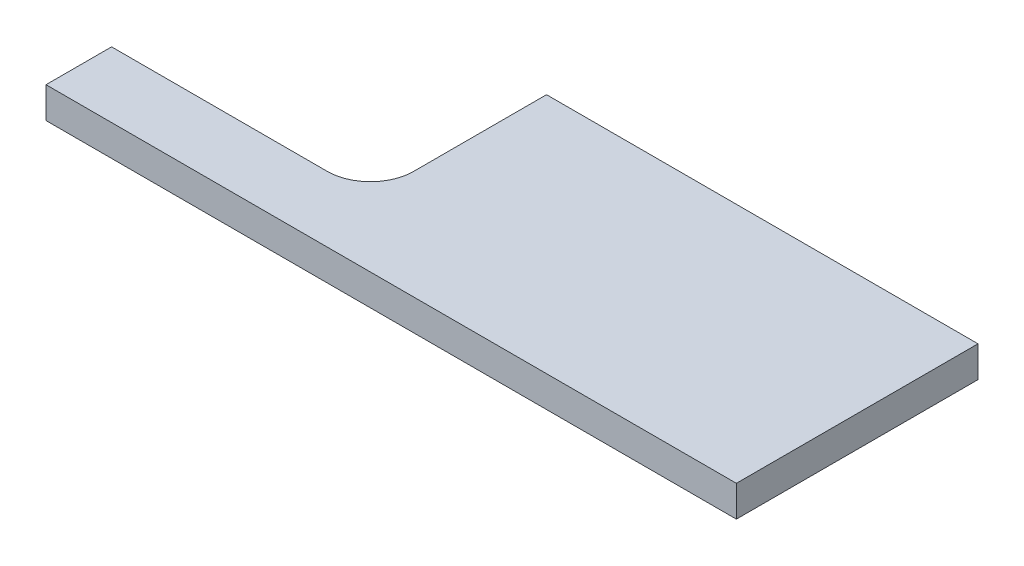
ISO-10303-21;
HEADER;
FILE_DESCRIPTION(('STEP AP214'),'2;1');
FILE_NAME('part.step','',(''),(''),'','','');
FILE_SCHEMA(('AUTOMOTIVE_DESIGN { 1 0 10303 214 1 1 1 1 }'));
ENDSEC;
DATA;
#1=APPLICATION_CONTEXT('core data for automotive mechanical design processes');
#2=APPLICATION_PROTOCOL_DEFINITION('international standard','automotive_design',2000,#1);
#3=PRODUCT_CONTEXT('',#1,'mechanical');
#4=PRODUCT('Part','Part','',(#3));
#5=PRODUCT_RELATED_PRODUCT_CATEGORY('part','',(#4));
#6=PRODUCT_DEFINITION_FORMATION('','',#4);
#7=PRODUCT_DEFINITION_CONTEXT('part definition',#1,'design');
#8=PRODUCT_DEFINITION('design','',#6,#7);
#9=PRODUCT_DEFINITION_SHAPE('','',#8);
#10=(LENGTH_UNIT() NAMED_UNIT(*) SI_UNIT(.MILLI.,.METRE.));
#11=(NAMED_UNIT(*) PLANE_ANGLE_UNIT() SI_UNIT($,.RADIAN.));
#12=(NAMED_UNIT(*) SI_UNIT($,.STERADIAN.) SOLID_ANGLE_UNIT());
#13=UNCERTAINTY_MEASURE_WITH_UNIT(LENGTH_MEASURE(1.E-05),#10,'distance_accuracy_value','');
#14=(GEOMETRIC_REPRESENTATION_CONTEXT(3) GLOBAL_UNCERTAINTY_ASSIGNED_CONTEXT((#13)) GLOBAL_UNIT_ASSIGNED_CONTEXT((#10,
#11,#12)) REPRESENTATION_CONTEXT('',''));
#15=CARTESIAN_POINT('',(0.,0.,0.));
#16=DIRECTION('',(0.,0.,1.));
#17=DIRECTION('',(1.,0.,0.));
#18=AXIS2_PLACEMENT_3D('',#15,#16,#17);
#19=CARTESIAN_POINT('',(66.9814991871768,18.,-25.));
#20=DIRECTION('',(1.,0.,0.));
#21=DIRECTION('',(0.,0.,-1.));
#22=AXIS2_PLACEMENT_3D('',#19,#20,#21);
#23=PLANE('',#22);
#24=DIRECTION('',(0.,0.,1.));
#25=VECTOR('',#24,1.);
#26=CARTESIAN_POINT('',(66.9814991871768,0.,-25.));
#27=LINE('',#26,#25);
#28=CARTESIAN_POINT('',(66.9814991871768,0.,-102.));
#29=VERTEX_POINT('',#28);
#30=CARTESIAN_POINT('',(66.9814991871768,0.,-25.));
#31=VERTEX_POINT('',#30);
#32=EDGE_CURVE('E121',#29,#31,#27,.T.);
#33=ORIENTED_EDGE('',*,*,#32,.T.);
#34=DIRECTION('',(0.,-1.,0.));
#35=VECTOR('',#34,1.);
#36=CARTESIAN_POINT('',(66.9814991871768,18.,-25.));
#37=LINE('',#36,#35);
#38=CARTESIAN_POINT('',(66.9814991871768,18.,-25.));
#39=VERTEX_POINT('',#38);
#40=EDGE_CURVE('E11',#39,#31,#37,.T.);
#41=ORIENTED_EDGE('',*,*,#40,.F.);
#42=DIRECTION('',(0.,0.,1.));
#43=VECTOR('',#42,1.);
#44=CARTESIAN_POINT('',(66.9814991871768,18.,-25.));
#45=LINE('',#44,#43);
#46=CARTESIAN_POINT('',(66.9814991871768,18.,-102.));
#47=VERTEX_POINT('',#46);
#48=EDGE_CURVE('E133',#47,#39,#45,.T.);
#49=ORIENTED_EDGE('',*,*,#48,.F.);
#50=DIRECTION('',(0.,-1.,0.));
#51=VECTOR('',#50,1.);
#52=CARTESIAN_POINT('',(66.9814991871768,18.,-102.));
#53=LINE('',#52,#51);
#54=EDGE_CURVE('E117',#47,#29,#53,.T.);
#55=ORIENTED_EDGE('',*,*,#54,.T.);
#56=EDGE_LOOP('',(#33,#41,#49,#55));
#57=FACE_BOUND('',#56,.T.);
#58=ADVANCED_FACE('F31',(#57),#23,.F.);
#59=CARTESIAN_POINT('',(41.9814991871768,18.,-25.));
#60=DIRECTION('',(0.,-1.,0.));
#61=DIRECTION('',(0.,0.,-1.));
#62=AXIS2_PLACEMENT_3D('',#59,#60,#61);
#63=CYLINDRICAL_SURFACE('',#62,25.);
#64=CARTESIAN_POINT('',(41.9814991871768,0.,-25.));
#65=DIRECTION('',(0.,-1.,0.));
#66=DIRECTION('',(0.,0.,1.));
#67=AXIS2_PLACEMENT_3D('',#64,#65,#66);
#68=CIRCLE('',#67,25.);
#69=CARTESIAN_POINT('',(41.9814991871768,0.,0.));
#70=VERTEX_POINT('',#69);
#71=EDGE_CURVE('E124',#31,#70,#68,.T.);
#72=ORIENTED_EDGE('',*,*,#71,.T.);
#73=DIRECTION('',(0.,-1.,0.));
#74=VECTOR('',#73,1.);
#75=CARTESIAN_POINT('',(41.9814991871768,18.,0.));
#76=LINE('',#75,#74);
#77=CARTESIAN_POINT('',(41.9814991871768,18.,0.));
#78=VERTEX_POINT('',#77);
#79=EDGE_CURVE('E39',#78,#70,#76,.T.);
#80=ORIENTED_EDGE('',*,*,#79,.F.);
#81=CARTESIAN_POINT('',(41.9814991871768,18.,-25.));
#82=DIRECTION('',(0.,-1.,0.));
#83=DIRECTION('',(0.,0.,1.));
#84=AXIS2_PLACEMENT_3D('',#81,#82,#83);
#85=CIRCLE('',#84,25.);
#86=EDGE_CURVE('E87',#39,#78,#85,.T.);
#87=ORIENTED_EDGE('',*,*,#86,.F.);
#88=ORIENTED_EDGE('',*,*,#40,.T.);
#89=EDGE_LOOP('',(#72,#80,#87,#88));
#90=FACE_BOUND('',#89,.T.);
#91=ADVANCED_FACE('F158',(#90),#63,.F.);
#92=CARTESIAN_POINT('',(-83.0185008128232,18.,0.));
#93=DIRECTION('',(0.,0.,1.));
#94=DIRECTION('',(1.,0.,0.));
#95=AXIS2_PLACEMENT_3D('',#92,#93,#94);
#96=PLANE('',#95);
#97=DIRECTION('',(-1.,0.,0.));
#98=VECTOR('',#97,1.);
#99=CARTESIAN_POINT('',(-83.0185008128232,0.,0.));
#100=LINE('',#99,#98);
#101=CARTESIAN_POINT('',(-83.0185008128232,0.,0.));
#102=VERTEX_POINT('',#101);
#103=EDGE_CURVE('E126',#70,#102,#100,.T.);
#104=ORIENTED_EDGE('',*,*,#103,.T.);
#105=DIRECTION('',(0.,-1.,0.));
#106=VECTOR('',#105,1.);
#107=CARTESIAN_POINT('',(-83.0185008128232,18.,0.));
#108=LINE('',#107,#106);
#109=CARTESIAN_POINT('',(-83.0185008128232,18.,0.));
#110=VERTEX_POINT('',#109);
#111=EDGE_CURVE('E137',#110,#102,#108,.T.);
#112=ORIENTED_EDGE('',*,*,#111,.F.);
#113=DIRECTION('',(-1.,0.,0.));
#114=VECTOR('',#113,1.);
#115=CARTESIAN_POINT('',(-83.0185008128232,18.,0.));
#116=LINE('',#115,#114);
#117=EDGE_CURVE('E145',#78,#110,#116,.T.);
#118=ORIENTED_EDGE('',*,*,#117,.F.);
#119=ORIENTED_EDGE('',*,*,#79,.T.);
#120=EDGE_LOOP('',(#104,#112,#118,#119));
#121=FACE_BOUND('',#120,.T.);
#122=ADVANCED_FACE('F143',(#121),#96,.F.);
#123=CARTESIAN_POINT('',(-83.0185008128232,18.,38.));
#124=DIRECTION('',(1.,0.,0.));
#125=DIRECTION('',(0.,0.,-1.));
#126=AXIS2_PLACEMENT_3D('',#123,#124,#125);
#127=PLANE('',#126);
#128=DIRECTION('',(0.,0.,1.));
#129=VECTOR('',#128,1.);
#130=CARTESIAN_POINT('',(-83.0185008128232,0.,38.));
#131=LINE('',#130,#129);
#132=CARTESIAN_POINT('',(-83.0185008128232,0.,38.));
#133=VERTEX_POINT('',#132);
#134=EDGE_CURVE('E128',#102,#133,#131,.T.);
#135=ORIENTED_EDGE('',*,*,#134,.T.);
#136=DIRECTION('',(0.,-1.,0.));
#137=VECTOR('',#136,1.);
#138=CARTESIAN_POINT('',(-83.0185008128232,18.,38.));
#139=LINE('',#138,#137);
#140=CARTESIAN_POINT('',(-83.0185008128232,18.,38.));
#141=VERTEX_POINT('',#140);
#142=EDGE_CURVE('E112',#141,#133,#139,.T.);
#143=ORIENTED_EDGE('',*,*,#142,.F.);
#144=DIRECTION('',(0.,0.,1.));
#145=VECTOR('',#144,1.);
#146=CARTESIAN_POINT('',(-83.0185008128232,18.,38.));
#147=LINE('',#146,#145);
#148=EDGE_CURVE('E103',#110,#141,#147,.T.);
#149=ORIENTED_EDGE('',*,*,#148,.F.);
#150=ORIENTED_EDGE('',*,*,#111,.T.);
#151=EDGE_LOOP('',(#135,#143,#149,#150));
#152=FACE_BOUND('',#151,.T.);
#153=ADVANCED_FACE('F151',(#152),#127,.F.);
#154=CARTESIAN_POINT('',(316.981499187177,18.,38.));
#155=DIRECTION('',(0.,0.,-1.));
#156=DIRECTION('',(-1.,0.,0.));
#157=AXIS2_PLACEMENT_3D('',#154,#155,#156);
#158=PLANE('',#157);
#159=DIRECTION('',(1.,0.,0.));
#160=VECTOR('',#159,1.);
#161=CARTESIAN_POINT('',(316.981499187177,0.,38.));
#162=LINE('',#161,#160);
#163=CARTESIAN_POINT('',(316.981499187177,0.,38.));
#164=VERTEX_POINT('',#163);
#165=EDGE_CURVE('E111',#133,#164,#162,.T.);
#166=ORIENTED_EDGE('',*,*,#165,.T.);
#167=DIRECTION('',(0.,-1.,0.));
#168=VECTOR('',#167,1.);
#169=CARTESIAN_POINT('',(316.981499187177,18.,38.));
#170=LINE('',#169,#168);
#171=CARTESIAN_POINT('',(316.981499187177,18.,38.));
#172=VERTEX_POINT('',#171);
#173=EDGE_CURVE('E108',#172,#164,#170,.T.);
#174=ORIENTED_EDGE('',*,*,#173,.F.);
#175=DIRECTION('',(1.,0.,0.));
#176=VECTOR('',#175,1.);
#177=CARTESIAN_POINT('',(316.981499187177,18.,38.));
#178=LINE('',#177,#176);
#179=EDGE_CURVE('E97',#141,#172,#178,.T.);
#180=ORIENTED_EDGE('',*,*,#179,.F.);
#181=ORIENTED_EDGE('',*,*,#142,.T.);
#182=EDGE_LOOP('',(#166,#174,#180,#181));
#183=FACE_BOUND('',#182,.T.);
#184=ADVANCED_FACE('F109',(#183),#158,.F.);
#185=CARTESIAN_POINT('',(316.981499187177,18.,-102.));
#186=DIRECTION('',(-1.,0.,0.));
#187=DIRECTION('',(0.,0.,1.));
#188=AXIS2_PLACEMENT_3D('',#185,#186,#187);
#189=PLANE('',#188);
#190=DIRECTION('',(0.,0.,-1.));
#191=VECTOR('',#190,1.);
#192=CARTESIAN_POINT('',(316.981499187177,0.,-102.));
#193=LINE('',#192,#191);
#194=CARTESIAN_POINT('',(316.981499187177,0.,-102.));
#195=VERTEX_POINT('',#194);
#196=EDGE_CURVE('E73',#164,#195,#193,.T.);
#197=ORIENTED_EDGE('',*,*,#196,.T.);
#198=DIRECTION('',(0.,-1.,0.));
#199=VECTOR('',#198,1.);
#200=CARTESIAN_POINT('',(316.981499187177,18.,-102.));
#201=LINE('',#200,#199);
#202=CARTESIAN_POINT('',(316.981499187177,18.,-102.));
#203=VERTEX_POINT('',#202);
#204=EDGE_CURVE('E113',#203,#195,#201,.T.);
#205=ORIENTED_EDGE('',*,*,#204,.F.);
#206=DIRECTION('',(0.,0.,-1.));
#207=VECTOR('',#206,1.);
#208=CARTESIAN_POINT('',(316.981499187177,18.,-102.));
#209=LINE('',#208,#207);
#210=EDGE_CURVE('E101',#172,#203,#209,.T.);
#211=ORIENTED_EDGE('',*,*,#210,.F.);
#212=ORIENTED_EDGE('',*,*,#173,.T.);
#213=EDGE_LOOP('',(#197,#205,#211,#212));
#214=FACE_BOUND('',#213,.T.);
#215=ADVANCED_FACE('F115',(#214),#189,.F.);
#216=CARTESIAN_POINT('',(66.9814991871768,18.,-102.));
#217=DIRECTION('',(0.,0.,1.));
#218=DIRECTION('',(1.,0.,0.));
#219=AXIS2_PLACEMENT_3D('',#216,#217,#218);
#220=PLANE('',#219);
#221=DIRECTION('',(-1.,0.,0.));
#222=VECTOR('',#221,1.);
#223=CARTESIAN_POINT('',(66.9814991871768,0.,-102.));
#224=LINE('',#223,#222);
#225=EDGE_CURVE('E79',#195,#29,#224,.T.);
#226=ORIENTED_EDGE('',*,*,#225,.T.);
#227=ORIENTED_EDGE('',*,*,#54,.F.);
#228=DIRECTION('',(-1.,0.,0.));
#229=VECTOR('',#228,1.);
#230=CARTESIAN_POINT('',(66.9814991871768,18.,-102.));
#231=LINE('',#230,#229);
#232=EDGE_CURVE('E47',#203,#47,#231,.T.);
#233=ORIENTED_EDGE('',*,*,#232,.F.);
#234=ORIENTED_EDGE('',*,*,#204,.T.);
#235=EDGE_LOOP('',(#226,#227,#233,#234));
#236=FACE_BOUND('',#235,.T.);
#237=ADVANCED_FACE('F172',(#236),#220,.F.);
#238=CARTESIAN_POINT('',(41.9814991871768,18.,-25.));
#239=DIRECTION('',(0.,1.,0.));
#240=DIRECTION('',(0.,0.,1.));
#241=AXIS2_PLACEMENT_3D('',#238,#239,#240);
#242=PLANE('',#241);
#243=ORIENTED_EDGE('',*,*,#48,.T.);
#244=ORIENTED_EDGE('',*,*,#86,.T.);
#245=ORIENTED_EDGE('',*,*,#117,.T.);
#246=ORIENTED_EDGE('',*,*,#148,.T.);
#247=ORIENTED_EDGE('',*,*,#179,.T.);
#248=ORIENTED_EDGE('',*,*,#210,.T.);
#249=ORIENTED_EDGE('',*,*,#232,.T.);
#250=EDGE_LOOP('',(#243,#244,#245,#246,#247,#248,#249));
#251=FACE_BOUND('',#250,.T.);
#252=ADVANCED_FACE('F99',(#251),#242,.T.);
#253=CARTESIAN_POINT('',(41.9814991871768,0.,-25.));
#254=DIRECTION('',(0.,1.,0.));
#255=DIRECTION('',(0.,0.,1.));
#256=AXIS2_PLACEMENT_3D('',#253,#254,#255);
#257=PLANE('',#256);
#258=ORIENTED_EDGE('',*,*,#32,.F.);
#259=ORIENTED_EDGE('',*,*,#225,.F.);
#260=ORIENTED_EDGE('',*,*,#196,.F.);
#261=ORIENTED_EDGE('',*,*,#165,.F.);
#262=ORIENTED_EDGE('',*,*,#134,.F.);
#263=ORIENTED_EDGE('',*,*,#103,.F.);
#264=ORIENTED_EDGE('',*,*,#71,.F.);
#265=EDGE_LOOP('',(#258,#259,#260,#261,#262,#263,#264));
#266=FACE_BOUND('',#265,.T.);
#267=ADVANCED_FACE('F149',(#266),#257,.F.);
#268=CLOSED_SHELL('',(#58,#91,#122,#153,#184,#215,#237,#252,#267));
#269=MANIFOLD_SOLID_BREP('B2',#268);
#270=ADVANCED_BREP_SHAPE_REPRESENTATION('',(#18,#269),#14);
#271=SHAPE_DEFINITION_REPRESENTATION(#9,#270);
ENDSEC;
END-ISO-10303-21;
